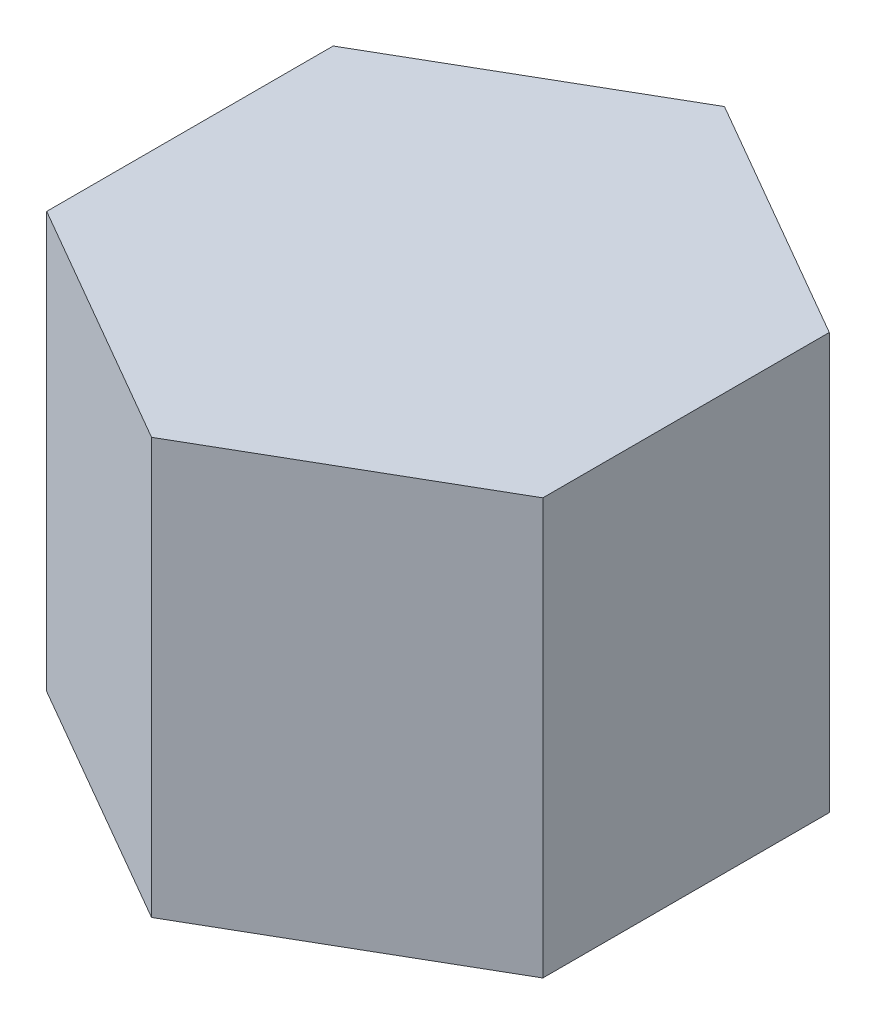
ISO-10303-21;
HEADER;
FILE_DESCRIPTION(('STEP AP214'),'2;1');
FILE_NAME('part.step','',(''),(''),'','','');
FILE_SCHEMA(('AUTOMOTIVE_DESIGN { 1 0 10303 214 1 1 1 1 }'));
ENDSEC;
DATA;
#1=APPLICATION_CONTEXT('core data for automotive mechanical design processes');
#2=APPLICATION_PROTOCOL_DEFINITION('international standard','automotive_design',2000,#1);
#3=PRODUCT_CONTEXT('',#1,'mechanical');
#4=PRODUCT('Part','Part','',(#3));
#5=PRODUCT_RELATED_PRODUCT_CATEGORY('part','',(#4));
#6=PRODUCT_DEFINITION_FORMATION('','',#4);
#7=PRODUCT_DEFINITION_CONTEXT('part definition',#1,'design');
#8=PRODUCT_DEFINITION('design','',#6,#7);
#9=PRODUCT_DEFINITION_SHAPE('','',#8);
#10=(LENGTH_UNIT() NAMED_UNIT(*) SI_UNIT(.MILLI.,.METRE.));
#11=(NAMED_UNIT(*) PLANE_ANGLE_UNIT() SI_UNIT($,.RADIAN.));
#12=(NAMED_UNIT(*) SI_UNIT($,.STERADIAN.) SOLID_ANGLE_UNIT());
#13=UNCERTAINTY_MEASURE_WITH_UNIT(LENGTH_MEASURE(1.E-05),#10,'distance_accuracy_value','');
#14=(GEOMETRIC_REPRESENTATION_CONTEXT(3) GLOBAL_UNCERTAINTY_ASSIGNED_CONTEXT((#13)) GLOBAL_UNIT_ASSIGNED_CONTEXT((#10,
#11,#12)) REPRESENTATION_CONTEXT('',''));
#15=CARTESIAN_POINT('',(0.,0.,0.));
#16=DIRECTION('',(0.,0.,1.));
#17=DIRECTION('',(1.,0.,0.));
#18=AXIS2_PLACEMENT_3D('',#15,#16,#17);
#19=CARTESIAN_POINT('',(210.142660308706,-148.537700895744,290.64094581671));
#20=DIRECTION('',(-0.499999999999943,0.,-0.866025403784472));
#21=DIRECTION('',(-0.866025403784472,0.,0.499999999999943));
#22=AXIS2_PLACEMENT_3D('',#19,#20,#21);
#23=PLANE('',#22);
#24=CARTESIAN_POINT('',(209.839551417382,-149.045793579175,290.81594581671));
#25=DIRECTION('',(0.866025403784471,0.,-0.499999999999943));
#26=VECTOR('',#25,1.);
#27=LINE('',#24,#26);
#28=CARTESIAN_POINT('',(209.839551417382,-149.045793579175,290.81594581671));
#29=VERTEX_POINT('',#28);
#30=CARTESIAN_POINT('',(210.142660308706,-149.045793579175,290.64094581671));
#31=VERTEX_POINT('',#30);
#32=EDGE_CURVE('E170',#29,#31,#27,.T.);
#33=ORIENTED_EDGE('',*,*,#32,.T.);
#34=CARTESIAN_POINT('',(210.142660308706,-148.537700895744,290.64094581671));
#35=DIRECTION('',(0.,-1.,0.));
#36=VECTOR('',#35,1.);
#37=LINE('',#34,#36);
#38=CARTESIAN_POINT('',(210.142660308706,-148.537700895744,290.64094581671));
#39=VERTEX_POINT('',#38);
#40=EDGE_CURVE('E35',#39,#31,#37,.T.);
#41=ORIENTED_EDGE('',*,*,#40,.F.);
#42=CARTESIAN_POINT('',(209.839551417382,-148.537700895744,290.81594581671));
#43=DIRECTION('',(0.866025403784471,0.,-0.499999999999943));
#44=VECTOR('',#43,1.);
#45=LINE('',#42,#44);
#46=CARTESIAN_POINT('',(209.839551417382,-148.537700895744,290.81594581671));
#47=VERTEX_POINT('',#46);
#48=EDGE_CURVE('E159',#47,#39,#45,.T.);
#49=ORIENTED_EDGE('',*,*,#48,.F.);
#50=CARTESIAN_POINT('',(209.839551417382,-148.537700895744,290.81594581671));
#51=DIRECTION('',(0.,-1.,0.));
#52=VECTOR('',#51,1.);
#53=LINE('',#50,#52);
#54=EDGE_CURVE('E10',#47,#29,#53,.T.);
#55=ORIENTED_EDGE('',*,*,#54,.T.);
#56=EDGE_LOOP('',(#33,#41,#49,#55));
#57=FACE_BOUND('',#56,.T.);
#58=ADVANCED_FACE('F16',(#57),#23,.F.);
#59=CARTESIAN_POINT('',(209.839551417382,-148.537700895744,290.81594581671));
#60=DIRECTION('',(0.500000000000062,0.,-0.866025403784403));
#61=DIRECTION('',(-0.866025403784403,0.,-0.500000000000062));
#62=AXIS2_PLACEMENT_3D('',#59,#60,#61);
#63=PLANE('',#62);
#64=CARTESIAN_POINT('',(209.536442526057,-149.045793579175,290.64094581671));
#65=DIRECTION('',(0.866025403784403,0.,0.500000000000062));
#66=VECTOR('',#65,1.);
#67=LINE('',#64,#66);
#68=CARTESIAN_POINT('',(209.536442526057,-149.045793579175,290.64094581671));
#69=VERTEX_POINT('',#68);
#70=EDGE_CURVE('E167',#69,#29,#67,.T.);
#71=ORIENTED_EDGE('',*,*,#70,.T.);
#72=ORIENTED_EDGE('',*,*,#54,.F.);
#73=CARTESIAN_POINT('',(209.536442526057,-148.537700895744,290.64094581671));
#74=DIRECTION('',(0.866025403784403,0.,0.500000000000062));
#75=VECTOR('',#74,1.);
#76=LINE('',#73,#75);
#77=CARTESIAN_POINT('',(209.536442526057,-148.537700895744,290.64094581671));
#78=VERTEX_POINT('',#77);
#79=EDGE_CURVE('E156',#78,#47,#76,.T.);
#80=ORIENTED_EDGE('',*,*,#79,.F.);
#81=CARTESIAN_POINT('',(209.536442526057,-148.537700895744,290.64094581671));
#82=DIRECTION('',(0.,-1.,0.));
#83=VECTOR('',#82,1.);
#84=LINE('',#81,#83);
#85=EDGE_CURVE('E27',#78,#69,#84,.T.);
#86=ORIENTED_EDGE('',*,*,#85,.T.);
#87=EDGE_LOOP('',(#71,#72,#80,#86));
#88=FACE_BOUND('',#87,.T.);
#89=ADVANCED_FACE('F189',(#88),#63,.F.);
#90=CARTESIAN_POINT('',(209.536442526057,-148.537700895744,290.831971220494));
#91=DIRECTION('',(1.,0.,0.));
#92=DIRECTION('',(0.,1.,0.));
#93=AXIS2_PLACEMENT_3D('',#90,#91,#92);
#94=PLANE('',#93);
#95=CARTESIAN_POINT('',(209.536442526057,-149.045793579175,290.29094581671));
#96=DIRECTION('',(0.,0.,1.));
#97=VECTOR('',#96,1.);
#98=LINE('',#95,#97);
#99=CARTESIAN_POINT('',(209.536442526057,-149.045793579175,290.29094581671));
#100=VERTEX_POINT('',#99);
#101=EDGE_CURVE('E163',#100,#69,#98,.T.);
#102=ORIENTED_EDGE('',*,*,#101,.T.);
#103=ORIENTED_EDGE('',*,*,#85,.F.);
#104=CARTESIAN_POINT('',(209.536442526057,-148.537700895744,290.29094581671));
#105=DIRECTION('',(0.,0.,1.));
#106=VECTOR('',#105,1.);
#107=LINE('',#104,#106);
#108=CARTESIAN_POINT('',(209.536442526057,-148.537700895744,290.29094581671));
#109=VERTEX_POINT('',#108);
#110=EDGE_CURVE('E106',#109,#78,#107,.T.);
#111=ORIENTED_EDGE('',*,*,#110,.F.);
#112=CARTESIAN_POINT('',(209.536442526057,-148.537700895744,290.29094581671));
#113=DIRECTION('',(0.,-1.,0.));
#114=VECTOR('',#113,1.);
#115=LINE('',#112,#114);
#116=EDGE_CURVE('E94',#109,#100,#115,.T.);
#117=ORIENTED_EDGE('',*,*,#116,.T.);
#118=EDGE_LOOP('',(#102,#103,#111,#117));
#119=FACE_BOUND('',#118,.T.);
#120=ADVANCED_FACE('F198',(#119),#94,.F.);
#121=CARTESIAN_POINT('',(209.536442526057,-148.537700895744,290.29094581671));
#122=DIRECTION('',(0.499999999999943,0.,0.866025403784472));
#123=DIRECTION('',(0.866025403784472,0.,-0.499999999999943));
#124=AXIS2_PLACEMENT_3D('',#121,#122,#123);
#125=PLANE('',#124);
#126=CARTESIAN_POINT('',(209.839551417382,-149.045793579175,290.11594581671));
#127=DIRECTION('',(-0.866025403784471,0.,0.499999999999943));
#128=VECTOR('',#127,1.);
#129=LINE('',#126,#128);
#130=CARTESIAN_POINT('',(209.839551417382,-149.045793579175,290.11594581671));
#131=VERTEX_POINT('',#130);
#132=EDGE_CURVE('E162',#131,#100,#129,.T.);
#133=ORIENTED_EDGE('',*,*,#132,.T.);
#134=ORIENTED_EDGE('',*,*,#116,.F.);
#135=CARTESIAN_POINT('',(209.839551417382,-148.537700895744,290.11594581671));
#136=DIRECTION('',(-0.866025403784471,0.,0.499999999999943));
#137=VECTOR('',#136,1.);
#138=LINE('',#135,#137);
#139=CARTESIAN_POINT('',(209.839551417382,-148.537700895744,290.11594581671));
#140=VERTEX_POINT('',#139);
#141=EDGE_CURVE('E98',#140,#109,#138,.T.);
#142=ORIENTED_EDGE('',*,*,#141,.F.);
#143=CARTESIAN_POINT('',(209.839551417382,-148.537700895744,290.11594581671));
#144=DIRECTION('',(0.,-1.,0.));
#145=VECTOR('',#144,1.);
#146=LINE('',#143,#145);
#147=EDGE_CURVE('E79',#140,#131,#146,.T.);
#148=ORIENTED_EDGE('',*,*,#147,.T.);
#149=EDGE_LOOP('',(#133,#134,#142,#148));
#150=FACE_BOUND('',#149,.T.);
#151=ADVANCED_FACE('F100',(#150),#125,.F.);
#152=CARTESIAN_POINT('',(209.839551417382,-148.537700895744,290.11594581671));
#153=DIRECTION('',(-0.500000000000062,0.,0.866025403784403));
#154=DIRECTION('',(0.866025403784403,0.,0.500000000000062));
#155=AXIS2_PLACEMENT_3D('',#152,#153,#154);
#156=PLANE('',#155);
#157=CARTESIAN_POINT('',(210.142660308706,-149.045793579175,290.29094581671));
#158=DIRECTION('',(-0.866025403784403,0.,-0.500000000000062));
#159=VECTOR('',#158,1.);
#160=LINE('',#157,#159);
#161=CARTESIAN_POINT('',(210.142660308706,-149.045793579175,290.29094581671));
#162=VERTEX_POINT('',#161);
#163=EDGE_CURVE('E88',#162,#131,#160,.T.);
#164=ORIENTED_EDGE('',*,*,#163,.T.);
#165=ORIENTED_EDGE('',*,*,#147,.F.);
#166=CARTESIAN_POINT('',(210.142660308706,-148.537700895744,290.29094581671));
#167=DIRECTION('',(-0.866025403784403,0.,-0.500000000000062));
#168=VECTOR('',#167,1.);
#169=LINE('',#166,#168);
#170=CARTESIAN_POINT('',(210.142660308706,-148.537700895744,290.29094581671));
#171=VERTEX_POINT('',#170);
#172=EDGE_CURVE('E84',#171,#140,#169,.T.);
#173=ORIENTED_EDGE('',*,*,#172,.F.);
#174=CARTESIAN_POINT('',(210.142660308706,-148.537700895744,290.29094581671));
#175=DIRECTION('',(0.,-1.,0.));
#176=VECTOR('',#175,1.);
#177=LINE('',#174,#176);
#178=EDGE_CURVE('E58',#171,#162,#177,.T.);
#179=ORIENTED_EDGE('',*,*,#178,.T.);
#180=EDGE_LOOP('',(#164,#165,#173,#179));
#181=FACE_BOUND('',#180,.T.);
#182=ADVANCED_FACE('F82',(#181),#156,.F.);
#183=CARTESIAN_POINT('',(210.142660308706,-148.537700895744,290.831971220494));
#184=DIRECTION('',(-1.,0.,0.));
#185=DIRECTION('',(0.,-1.,0.));
#186=AXIS2_PLACEMENT_3D('',#183,#184,#185);
#187=PLANE('',#186);
#188=CARTESIAN_POINT('',(210.142660308706,-149.045793579175,290.64094581671));
#189=DIRECTION('',(0.,0.,-1.));
#190=VECTOR('',#189,1.);
#191=LINE('',#188,#190);
#192=EDGE_CURVE('E160',#31,#162,#191,.T.);
#193=ORIENTED_EDGE('',*,*,#192,.T.);
#194=ORIENTED_EDGE('',*,*,#178,.F.);
#195=CARTESIAN_POINT('',(210.142660308706,-148.537700895744,290.64094581671));
#196=DIRECTION('',(0.,0.,-1.));
#197=VECTOR('',#196,1.);
#198=LINE('',#195,#197);
#199=EDGE_CURVE('E112',#39,#171,#198,.T.);
#200=ORIENTED_EDGE('',*,*,#199,.F.);
#201=ORIENTED_EDGE('',*,*,#40,.T.);
#202=EDGE_LOOP('',(#193,#194,#200,#201));
#203=FACE_BOUND('',#202,.T.);
#204=ADVANCED_FACE('F131',(#203),#187,.F.);
#205=CARTESIAN_POINT('',(206.339551417382,-148.537700895744,290.831971220494));
#206=DIRECTION('',(0.,-1.,0.));
#207=DIRECTION('',(1.,0.,0.));
#208=AXIS2_PLACEMENT_3D('',#205,#206,#207);
#209=PLANE('',#208);
#210=ORIENTED_EDGE('',*,*,#48,.T.);
#211=ORIENTED_EDGE('',*,*,#199,.T.);
#212=ORIENTED_EDGE('',*,*,#172,.T.);
#213=ORIENTED_EDGE('',*,*,#141,.T.);
#214=ORIENTED_EDGE('',*,*,#110,.T.);
#215=ORIENTED_EDGE('',*,*,#79,.T.);
#216=EDGE_LOOP('',(#210,#211,#212,#213,#214,#215));
#217=FACE_BOUND('',#216,.T.);
#218=ADVANCED_FACE('F111',(#217),#209,.F.);
#219=CARTESIAN_POINT('',(206.339551417382,-149.045793579175,290.831971220494));
#220=DIRECTION('',(0.,-1.,0.));
#221=DIRECTION('',(1.,0.,0.));
#222=AXIS2_PLACEMENT_3D('',#219,#220,#221);
#223=PLANE('',#222);
#224=ORIENTED_EDGE('',*,*,#32,.F.);
#225=ORIENTED_EDGE('',*,*,#70,.F.);
#226=ORIENTED_EDGE('',*,*,#101,.F.);
#227=ORIENTED_EDGE('',*,*,#132,.F.);
#228=ORIENTED_EDGE('',*,*,#163,.F.);
#229=ORIENTED_EDGE('',*,*,#192,.F.);
#230=EDGE_LOOP('',(#224,#225,#226,#227,#228,#229));
#231=FACE_BOUND('',#230,.T.);
#232=ADVANCED_FACE('F130',(#231),#223,.T.);
#233=CLOSED_SHELL('',(#58,#89,#120,#151,#182,#204,#218,#232));
#234=MANIFOLD_SOLID_BREP('B1',#233);
#235=ADVANCED_BREP_SHAPE_REPRESENTATION('',(#18,#234),#14);
#236=SHAPE_DEFINITION_REPRESENTATION(#9,#235);
ENDSEC;
END-ISO-10303-21;
